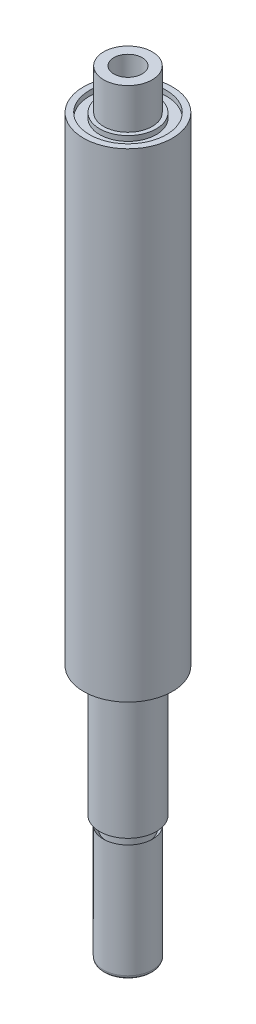
ISO-10303-21;
HEADER;
FILE_DESCRIPTION(('STEP AP214'),'2;1');
FILE_NAME('part.step','',(''),(''),'','','');
FILE_SCHEMA(('AUTOMOTIVE_DESIGN { 1 0 10303 214 1 1 1 1 }'));
ENDSEC;
DATA;
#1=APPLICATION_CONTEXT('core data for automotive mechanical design processes');
#2=APPLICATION_PROTOCOL_DEFINITION('international standard','automotive_design',2000,#1);
#3=PRODUCT_CONTEXT('',#1,'mechanical');
#4=PRODUCT('Part','Part','',(#3));
#5=PRODUCT_RELATED_PRODUCT_CATEGORY('part','',(#4));
#6=PRODUCT_DEFINITION_FORMATION('','',#4);
#7=PRODUCT_DEFINITION_CONTEXT('part definition',#1,'design');
#8=PRODUCT_DEFINITION('design','',#6,#7);
#9=PRODUCT_DEFINITION_SHAPE('','',#8);
#10=(LENGTH_UNIT() NAMED_UNIT(*) SI_UNIT(.MILLI.,.METRE.));
#11=(NAMED_UNIT(*) PLANE_ANGLE_UNIT() SI_UNIT($,.RADIAN.));
#12=(NAMED_UNIT(*) SI_UNIT($,.STERADIAN.) SOLID_ANGLE_UNIT());
#13=UNCERTAINTY_MEASURE_WITH_UNIT(LENGTH_MEASURE(1.E-05),#10,'distance_accuracy_value','');
#14=(GEOMETRIC_REPRESENTATION_CONTEXT(3) GLOBAL_UNCERTAINTY_ASSIGNED_CONTEXT((#13)) GLOBAL_UNIT_ASSIGNED_CONTEXT((#10,
#11,#12)) REPRESENTATION_CONTEXT('',''));
#15=CARTESIAN_POINT('',(0.,0.,0.));
#16=DIRECTION('',(0.,0.,1.));
#17=DIRECTION('',(1.,0.,0.));
#18=AXIS2_PLACEMENT_3D('',#15,#16,#17);
#19=CARTESIAN_POINT('',(0.,29.4848484848484,0.));
#20=DIRECTION('',(0.,1.,0.));
#21=DIRECTION('',(-1.,0.,0.));
#22=AXIS2_PLACEMENT_3D('',#19,#20,#21);
#23=CYLINDRICAL_SURFACE('',#22,5.99999999999999);
#24=CARTESIAN_POINT('',(0.,46.2828282828283,0.));
#25=DIRECTION('',(0.,1.,0.));
#26=DIRECTION('',(-1.,0.,0.));
#27=AXIS2_PLACEMENT_3D('',#24,#25,#26);
#28=CIRCLE('',#27,5.99999999999999);
#29=CARTESIAN_POINT('',(-5.99999999999999,46.2828282828283,0.));
#30=VERTEX_POINT('',#29);
#31=EDGE_CURVE('E86',#30,#30,#28,.T.);
#32=ORIENTED_EDGE('',*,*,#31,.F.);
#33=EDGE_LOOP('',(#32));
#34=FACE_BOUND('',#33,.T.);
#35=CARTESIAN_POINT('',(0.,36.2828282828282,0.));
#36=DIRECTION('',(0.,1.,0.));
#37=DIRECTION('',(-1.,0.,0.));
#38=AXIS2_PLACEMENT_3D('',#35,#36,#37);
#39=CIRCLE('',#38,5.99999999999999);
#40=CARTESIAN_POINT('',(-5.99999999999999,36.2828282828282,0.));
#41=VERTEX_POINT('',#40);
#42=EDGE_CURVE('E10',#41,#41,#39,.T.);
#43=ORIENTED_EDGE('',*,*,#42,.T.);
#44=EDGE_LOOP('',(#43));
#45=FACE_BOUND('',#44,.T.);
#46=ADVANCED_FACE('F31',(#34,#45),#23,.T.);
#47=CARTESIAN_POINT('',(5.99999999999999,36.2828282828282,0.));
#48=DIRECTION('',(0.,-1.,0.));
#49=DIRECTION('',(1.,0.,0.));
#50=AXIS2_PLACEMENT_3D('',#47,#48,#49);
#51=PLANE('',#50);
#52=ORIENTED_EDGE('',*,*,#42,.F.);
#53=EDGE_LOOP('',(#52));
#54=FACE_BOUND('',#53,.T.);
#55=CARTESIAN_POINT('',(0.,36.2828282828282,0.));
#56=DIRECTION('',(0.,1.,0.));
#57=DIRECTION('',(-1.,0.,0.));
#58=AXIS2_PLACEMENT_3D('',#55,#56,#57);
#59=CIRCLE('',#58,6.99999999999999);
#60=CARTESIAN_POINT('',(-6.99999999999999,36.2828282828282,0.));
#61=VERTEX_POINT('',#60);
#62=EDGE_CURVE('E37',#61,#61,#59,.T.);
#63=ORIENTED_EDGE('',*,*,#62,.T.);
#64=EDGE_LOOP('',(#63));
#65=FACE_BOUND('',#64,.T.);
#66=ADVANCED_FACE('F93',(#54,#65),#51,.F.);
#67=CARTESIAN_POINT('',(0.,29.4848484848484,0.));
#68=DIRECTION('',(0.,1.,0.));
#69=DIRECTION('',(-1.,0.,0.));
#70=AXIS2_PLACEMENT_3D('',#67,#68,#69);
#71=CYLINDRICAL_SURFACE('',#70,6.99999999999998);
#72=ORIENTED_EDGE('',*,*,#62,.F.);
#73=EDGE_LOOP('',(#72));
#74=FACE_BOUND('',#73,.T.);
#75=CARTESIAN_POINT('',(0.,35.0328282828282,0.));
#76=DIRECTION('',(0.,1.,0.));
#77=DIRECTION('',(-1.,0.,0.));
#78=AXIS2_PLACEMENT_3D('',#75,#76,#77);
#79=CIRCLE('',#78,6.99999999999998);
#80=CARTESIAN_POINT('',(-6.99999999999998,35.0328282828282,0.));
#81=VERTEX_POINT('',#80);
#82=EDGE_CURVE('E41',#81,#81,#79,.T.);
#83=ORIENTED_EDGE('',*,*,#82,.T.);
#84=EDGE_LOOP('',(#83));
#85=FACE_BOUND('',#84,.T.);
#86=ADVANCED_FACE('F97',(#74,#85),#71,.T.);
#87=CARTESIAN_POINT('',(6.99999999999997,35.0328282828282,0.));
#88=DIRECTION('',(0.,-1.,0.));
#89=DIRECTION('',(1.,0.,0.));
#90=AXIS2_PLACEMENT_3D('',#87,#88,#89);
#91=PLANE('',#90);
#92=ORIENTED_EDGE('',*,*,#82,.F.);
#93=EDGE_LOOP('',(#92));
#94=FACE_BOUND('',#93,.T.);
#95=CARTESIAN_POINT('',(0.,35.0328282828282,0.));
#96=DIRECTION('',(0.,1.,0.));
#97=DIRECTION('',(-1.,0.,0.));
#98=AXIS2_PLACEMENT_3D('',#95,#96,#97);
#99=CIRCLE('',#98,9.49999999999997);
#100=CARTESIAN_POINT('',(-9.49999999999997,35.0328282828282,0.));
#101=VERTEX_POINT('',#100);
#102=EDGE_CURVE('E45',#101,#101,#99,.T.);
#103=ORIENTED_EDGE('',*,*,#102,.T.);
#104=EDGE_LOOP('',(#103));
#105=FACE_BOUND('',#104,.T.);
#106=ADVANCED_FACE('F102',(#94,#105),#91,.F.);
#107=CARTESIAN_POINT('',(0.,29.4848484848484,0.));
#108=DIRECTION('',(0.,1.,0.));
#109=DIRECTION('',(-1.,0.,0.));
#110=AXIS2_PLACEMENT_3D('',#107,#108,#109);
#111=CYLINDRICAL_SURFACE('',#110,9.49999999999999);
#112=ORIENTED_EDGE('',*,*,#102,.F.);
#113=EDGE_LOOP('',(#112));
#114=FACE_BOUND('',#113,.T.);
#115=CARTESIAN_POINT('',(0.,36.2828282828282,0.));
#116=DIRECTION('',(0.,1.,0.));
#117=DIRECTION('',(-1.,0.,0.));
#118=AXIS2_PLACEMENT_3D('',#115,#116,#117);
#119=CIRCLE('',#118,9.5);
#120=CARTESIAN_POINT('',(-9.5,36.2828282828282,0.));
#121=VERTEX_POINT('',#120);
#122=EDGE_CURVE('E50',#121,#121,#119,.T.);
#123=ORIENTED_EDGE('',*,*,#122,.T.);
#124=EDGE_LOOP('',(#123));
#125=FACE_BOUND('',#124,.T.);
#126=ADVANCED_FACE('F108',(#114,#125),#111,.F.);
#127=CARTESIAN_POINT('',(9.5,36.2828282828282,0.));
#128=DIRECTION('',(0.,-1.,0.));
#129=DIRECTION('',(1.,0.,0.));
#130=AXIS2_PLACEMENT_3D('',#127,#128,#129);
#131=PLANE('',#130);
#132=ORIENTED_EDGE('',*,*,#122,.F.);
#133=EDGE_LOOP('',(#132));
#134=FACE_BOUND('',#133,.T.);
#135=CARTESIAN_POINT('',(0.,36.2828282828282,0.));
#136=DIRECTION('',(0.,1.,0.));
#137=DIRECTION('',(-1.,0.,0.));
#138=AXIS2_PLACEMENT_3D('',#135,#136,#137);
#139=CIRCLE('',#138,11.);
#140=CARTESIAN_POINT('',(-11.,36.2828282828282,0.));
#141=VERTEX_POINT('',#140);
#142=EDGE_CURVE('E53',#141,#141,#139,.T.);
#143=ORIENTED_EDGE('',*,*,#142,.T.);
#144=EDGE_LOOP('',(#143));
#145=FACE_BOUND('',#144,.T.);
#146=ADVANCED_FACE('F112',(#134,#145),#131,.F.);
#147=CARTESIAN_POINT('',(0.,29.4848484848484,0.));
#148=DIRECTION('',(0.,1.,0.));
#149=DIRECTION('',(-1.,0.,0.));
#150=AXIS2_PLACEMENT_3D('',#147,#148,#149);
#151=CYLINDRICAL_SURFACE('',#150,11.);
#152=ORIENTED_EDGE('',*,*,#142,.F.);
#153=EDGE_LOOP('',(#152));
#154=FACE_BOUND('',#153,.T.);
#155=CARTESIAN_POINT('',(0.,-82.2171717171717,0.));
#156=DIRECTION('',(0.,1.,0.));
#157=DIRECTION('',(-1.,0.,0.));
#158=AXIS2_PLACEMENT_3D('',#155,#156,#157);
#159=CIRCLE('',#158,11.);
#160=CARTESIAN_POINT('',(-11.,-82.2171717171717,0.));
#161=VERTEX_POINT('',#160);
#162=EDGE_CURVE('E56',#161,#161,#159,.T.);
#163=ORIENTED_EDGE('',*,*,#162,.T.);
#164=EDGE_LOOP('',(#163));
#165=FACE_BOUND('',#164,.T.);
#166=ADVANCED_FACE('F116',(#154,#165),#151,.T.);
#167=CARTESIAN_POINT('',(11.,-82.2171717171717,0.));
#168=DIRECTION('',(0.,1.,0.));
#169=DIRECTION('',(-1.,0.,0.));
#170=AXIS2_PLACEMENT_3D('',#167,#168,#169);
#171=PLANE('',#170);
#172=ORIENTED_EDGE('',*,*,#162,.F.);
#173=EDGE_LOOP('',(#172));
#174=FACE_BOUND('',#173,.T.);
#175=CARTESIAN_POINT('',(0.,-82.2171717171717,0.));
#176=DIRECTION('',(0.,1.,0.));
#177=DIRECTION('',(-1.,0.,0.));
#178=AXIS2_PLACEMENT_3D('',#175,#176,#177);
#179=CIRCLE('',#178,7.);
#180=CARTESIAN_POINT('',(-6.99999999999999,-82.2171717171717,0.));
#181=VERTEX_POINT('',#180);
#182=EDGE_CURVE('E59',#181,#181,#179,.T.);
#183=ORIENTED_EDGE('',*,*,#182,.T.);
#184=EDGE_LOOP('',(#183));
#185=FACE_BOUND('',#184,.T.);
#186=ADVANCED_FACE('F120',(#174,#185),#171,.F.);
#187=CARTESIAN_POINT('',(0.,29.4848484848484,0.));
#188=DIRECTION('',(0.,1.,0.));
#189=DIRECTION('',(-1.,0.,0.));
#190=AXIS2_PLACEMENT_3D('',#187,#188,#189);
#191=CYLINDRICAL_SURFACE('',#190,7.);
#192=ORIENTED_EDGE('',*,*,#182,.F.);
#193=EDGE_LOOP('',(#192));
#194=FACE_BOUND('',#193,.T.);
#195=CARTESIAN_POINT('',(0.,-114.217171717172,0.));
#196=DIRECTION('',(0.,1.,0.));
#197=DIRECTION('',(-1.,0.,0.));
#198=AXIS2_PLACEMENT_3D('',#195,#196,#197);
#199=CIRCLE('',#198,7.);
#200=CARTESIAN_POINT('',(-6.99999999999998,-114.217171717172,0.));
#201=VERTEX_POINT('',#200);
#202=EDGE_CURVE('E62',#201,#201,#199,.T.);
#203=ORIENTED_EDGE('',*,*,#202,.T.);
#204=EDGE_LOOP('',(#203));
#205=FACE_BOUND('',#204,.T.);
#206=ADVANCED_FACE('F124',(#194,#205),#191,.T.);
#207=CARTESIAN_POINT('',(7.00000000000001,-114.217171717172,0.));
#208=DIRECTION('',(0.,1.,0.));
#209=DIRECTION('',(-1.,0.,0.));
#210=AXIS2_PLACEMENT_3D('',#207,#208,#209);
#211=PLANE('',#210);
#212=ORIENTED_EDGE('',*,*,#202,.F.);
#213=EDGE_LOOP('',(#212));
#214=FACE_BOUND('',#213,.T.);
#215=CARTESIAN_POINT('',(0.,-114.217171717172,0.));
#216=DIRECTION('',(0.,1.,0.));
#217=DIRECTION('',(-1.,0.,0.));
#218=AXIS2_PLACEMENT_3D('',#215,#216,#217);
#219=CIRCLE('',#218,5.16161616161616);
#220=CARTESIAN_POINT('',(-5.16161616161614,-114.217171717172,0.));
#221=VERTEX_POINT('',#220);
#222=EDGE_CURVE('E65',#221,#221,#219,.T.);
#223=ORIENTED_EDGE('',*,*,#222,.T.);
#224=EDGE_LOOP('',(#223));
#225=FACE_BOUND('',#224,.T.);
#226=ADVANCED_FACE('F128',(#214,#225),#211,.F.);
#227=CARTESIAN_POINT('',(0.,29.4848484848484,0.));
#228=DIRECTION('',(0.,1.,0.));
#229=DIRECTION('',(-1.,0.,0.));
#230=AXIS2_PLACEMENT_3D('',#227,#228,#229);
#231=CYLINDRICAL_SURFACE('',#230,5.16161616161616);
#232=ORIENTED_EDGE('',*,*,#222,.F.);
#233=EDGE_LOOP('',(#232));
#234=FACE_BOUND('',#233,.T.);
#235=CARTESIAN_POINT('',(0.,-117.217171717172,0.));
#236=DIRECTION('',(0.,1.,0.));
#237=DIRECTION('',(-1.,0.,0.));
#238=AXIS2_PLACEMENT_3D('',#235,#236,#237);
#239=CIRCLE('',#238,5.16161616161615);
#240=CARTESIAN_POINT('',(-5.16161616161614,-117.217171717172,0.));
#241=VERTEX_POINT('',#240);
#242=EDGE_CURVE('E68',#241,#241,#239,.T.);
#243=ORIENTED_EDGE('',*,*,#242,.T.);
#244=EDGE_LOOP('',(#243));
#245=FACE_BOUND('',#244,.T.);
#246=ADVANCED_FACE('F132',(#234,#245),#231,.T.);
#247=CARTESIAN_POINT('',(0.,-116.29797979798,0.));
#248=DIRECTION('',(0.,1.,0.));
#249=DIRECTION('',(-1.,0.,0.));
#250=AXIS2_PLACEMENT_3D('',#247,#248,#249);
#251=CONICAL_SURFACE('',#250,6.08080808080806,0.785398163397436);
#252=ORIENTED_EDGE('',*,*,#242,.F.);
#253=EDGE_LOOP('',(#252));
#254=FACE_BOUND('',#253,.T.);
#255=CARTESIAN_POINT('',(0.,-116.29797979798,0.));
#256=DIRECTION('',(0.,1.,0.));
#257=DIRECTION('',(-1.,0.,0.));
#258=AXIS2_PLACEMENT_3D('',#255,#256,#257);
#259=CIRCLE('',#258,6.08080808080806);
#260=CARTESIAN_POINT('',(-6.08080808080805,-116.29797979798,0.));
#261=VERTEX_POINT('',#260);
#262=EDGE_CURVE('E71',#261,#261,#259,.T.);
#263=ORIENTED_EDGE('',*,*,#262,.T.);
#264=EDGE_LOOP('',(#263));
#265=FACE_BOUND('',#264,.T.);
#266=ADVANCED_FACE('F136',(#254,#265),#251,.F.);
#267=CARTESIAN_POINT('',(0.,29.4848484848484,0.));
#268=DIRECTION('',(0.,1.,0.));
#269=DIRECTION('',(-1.,0.,0.));
#270=AXIS2_PLACEMENT_3D('',#267,#268,#269);
#271=CYLINDRICAL_SURFACE('',#270,6.08080808080807);
#272=ORIENTED_EDGE('',*,*,#262,.F.);
#273=EDGE_LOOP('',(#272));
#274=FACE_BOUND('',#273,.T.);
#275=CARTESIAN_POINT('',(0.,-144.29797979798,0.));
#276=DIRECTION('',(0.,1.,0.));
#277=DIRECTION('',(-1.,0.,0.));
#278=AXIS2_PLACEMENT_3D('',#275,#276,#277);
#279=CIRCLE('',#278,6.08080808080807);
#280=CARTESIAN_POINT('',(-6.08080808080805,-144.29797979798,0.));
#281=VERTEX_POINT('',#280);
#282=EDGE_CURVE('E74',#281,#281,#279,.T.);
#283=ORIENTED_EDGE('',*,*,#282,.T.);
#284=EDGE_LOOP('',(#283));
#285=FACE_BOUND('',#284,.T.);
#286=ADVANCED_FACE('F140',(#274,#285),#271,.T.);
#287=CARTESIAN_POINT('',(0.,-144.29797979798,0.));
#288=DIRECTION('',(0.,1.,0.));
#289=DIRECTION('',(-1.,0.,0.));
#290=AXIS2_PLACEMENT_3D('',#287,#288,#289);
#291=TOROIDAL_SURFACE('',#290,5.16161616161614,0.919191919191924);
#292=ORIENTED_EDGE('',*,*,#282,.F.);
#293=EDGE_LOOP('',(#292));
#294=FACE_BOUND('',#293,.T.);
#295=CARTESIAN_POINT('',(0.,-145.217171717172,0.));
#296=DIRECTION('',(0.,1.,0.));
#297=DIRECTION('',(-1.,0.,0.));
#298=AXIS2_PLACEMENT_3D('',#295,#296,#297);
#299=CIRCLE('',#298,5.16161616161614);
#300=CARTESIAN_POINT('',(-5.16161616161613,-145.217171717172,0.));
#301=VERTEX_POINT('',#300);
#302=EDGE_CURVE('E77',#301,#301,#299,.T.);
#303=ORIENTED_EDGE('',*,*,#302,.T.);
#304=EDGE_LOOP('',(#303));
#305=FACE_BOUND('',#304,.T.);
#306=ADVANCED_FACE('F144',(#294,#305),#291,.T.);
#307=CARTESIAN_POINT('',(5.16161616161616,-145.217171717172,0.));
#308=DIRECTION('',(0.,1.,0.));
#309=DIRECTION('',(-1.,0.,0.));
#310=AXIS2_PLACEMENT_3D('',#307,#308,#309);
#311=PLANE('',#310);
#312=ORIENTED_EDGE('',*,*,#302,.F.);
#313=EDGE_LOOP('',(#312));
#314=FACE_BOUND('',#313,.T.);
#315=ADVANCED_FACE('F148',(#314),#311,.F.);
#316=CARTESIAN_POINT('',(0.,21.2828282828283,0.));
#317=DIRECTION('',(0.,-1.,0.));
#318=DIRECTION('',(1.,0.,0.));
#319=AXIS2_PLACEMENT_3D('',#316,#317,#318);
#320=PLANE('',#319);
#321=CARTESIAN_POINT('',(0.,21.2828282828283,0.));
#322=DIRECTION('',(0.,1.,0.));
#323=DIRECTION('',(-1.,0.,0.));
#324=AXIS2_PLACEMENT_3D('',#321,#322,#323);
#325=CIRCLE('',#324,3.5);
#326=CARTESIAN_POINT('',(-3.5,21.2828282828283,0.));
#327=VERTEX_POINT('',#326);
#328=EDGE_CURVE('E80',#327,#327,#325,.T.);
#329=ORIENTED_EDGE('',*,*,#328,.T.);
#330=EDGE_LOOP('',(#329));
#331=FACE_BOUND('',#330,.T.);
#332=ADVANCED_FACE('F152',(#331),#320,.F.);
#333=CARTESIAN_POINT('',(0.,29.4848484848484,0.));
#334=DIRECTION('',(0.,1.,0.));
#335=DIRECTION('',(-1.,0.,0.));
#336=AXIS2_PLACEMENT_3D('',#333,#334,#335);
#337=CYLINDRICAL_SURFACE('',#336,3.5);
#338=ORIENTED_EDGE('',*,*,#328,.F.);
#339=EDGE_LOOP('',(#338));
#340=FACE_BOUND('',#339,.T.);
#341=CARTESIAN_POINT('',(0.,46.2828282828283,0.));
#342=DIRECTION('',(0.,1.,0.));
#343=DIRECTION('',(-1.,0.,0.));
#344=AXIS2_PLACEMENT_3D('',#341,#342,#343);
#345=CIRCLE('',#344,3.5);
#346=CARTESIAN_POINT('',(-3.5,46.2828282828283,0.));
#347=VERTEX_POINT('',#346);
#348=EDGE_CURVE('E83',#347,#347,#345,.T.);
#349=ORIENTED_EDGE('',*,*,#348,.T.);
#350=EDGE_LOOP('',(#349));
#351=FACE_BOUND('',#350,.T.);
#352=ADVANCED_FACE('F156',(#340,#351),#337,.F.);
#353=CARTESIAN_POINT('',(3.49999999999999,46.2828282828283,0.));
#354=DIRECTION('',(0.,-1.,0.));
#355=DIRECTION('',(1.,0.,0.));
#356=AXIS2_PLACEMENT_3D('',#353,#354,#355);
#357=PLANE('',#356);
#358=ORIENTED_EDGE('',*,*,#348,.F.);
#359=EDGE_LOOP('',(#358));
#360=FACE_BOUND('',#359,.T.);
#361=ORIENTED_EDGE('',*,*,#31,.T.);
#362=EDGE_LOOP('',(#361));
#363=FACE_BOUND('',#362,.T.);
#364=ADVANCED_FACE('F90',(#360,#363),#357,.F.);
#365=CLOSED_SHELL('',(#46,#66,#86,#106,#126,#146,#166,#186,#206,#226,#246,#266,#286,#306,#315,
#332,#352,#364));
#366=MANIFOLD_SOLID_BREP('B2',#365);
#367=ADVANCED_BREP_SHAPE_REPRESENTATION('',(#18,#366),#14);
#368=SHAPE_DEFINITION_REPRESENTATION(#9,#367);
ENDSEC;
END-ISO-10303-21;
